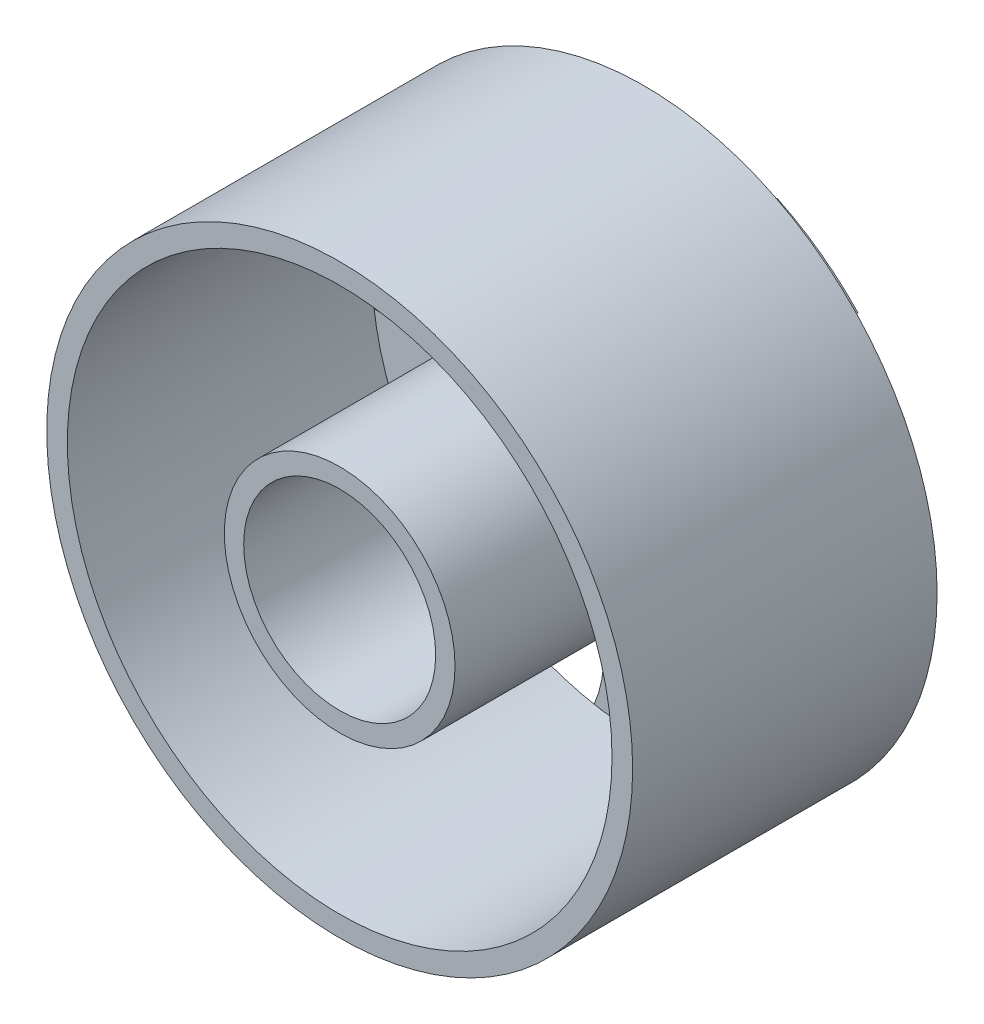
ISO-10303-21;
HEADER;
FILE_DESCRIPTION(('STEP AP214'),'2;1');
FILE_NAME('part.step','',(''),(''),'','','');
FILE_SCHEMA(('AUTOMOTIVE_DESIGN { 1 0 10303 214 1 1 1 1 }'));
ENDSEC;
DATA;
#1=APPLICATION_CONTEXT('core data for automotive mechanical design processes');
#2=APPLICATION_PROTOCOL_DEFINITION('international standard','automotive_design',2000,#1);
#3=PRODUCT_CONTEXT('',#1,'mechanical');
#4=PRODUCT('Part','Part','',(#3));
#5=PRODUCT_RELATED_PRODUCT_CATEGORY('part','',(#4));
#6=PRODUCT_DEFINITION_FORMATION('','',#4);
#7=PRODUCT_DEFINITION_CONTEXT('part definition',#1,'design');
#8=PRODUCT_DEFINITION('design','',#6,#7);
#9=PRODUCT_DEFINITION_SHAPE('','',#8);
#10=(LENGTH_UNIT() NAMED_UNIT(*) SI_UNIT(.MILLI.,.METRE.));
#11=(NAMED_UNIT(*) PLANE_ANGLE_UNIT() SI_UNIT($,.RADIAN.));
#12=(NAMED_UNIT(*) SI_UNIT($,.STERADIAN.) SOLID_ANGLE_UNIT());
#13=UNCERTAINTY_MEASURE_WITH_UNIT(LENGTH_MEASURE(1.E-05),#10,'distance_accuracy_value','');
#14=(GEOMETRIC_REPRESENTATION_CONTEXT(3) GLOBAL_UNCERTAINTY_ASSIGNED_CONTEXT((#13)) GLOBAL_UNIT_ASSIGNED_CONTEXT((#10,
#11,#12)) REPRESENTATION_CONTEXT('',''));
#15=CARTESIAN_POINT('',(0.,0.,0.));
#16=DIRECTION('',(0.,0.,1.));
#17=DIRECTION('',(1.,0.,0.));
#18=AXIS2_PLACEMENT_3D('',#15,#16,#17);
#19=CARTESIAN_POINT('',(0.,0.,-0.762000000000003));
#20=DIRECTION('',(0.,0.,1.));
#21=DIRECTION('',(1.,0.,0.));
#22=AXIS2_PLACEMENT_3D('',#19,#20,#21);
#23=CYLINDRICAL_SURFACE('',#22,12.9511267877965);
#24=CARTESIAN_POINT('',(0.,0.,0.));
#25=DIRECTION('',(0.,0.,-1.));
#26=DIRECTION('',(-1.,0.,0.));
#27=AXIS2_PLACEMENT_3D('',#24,#25,#26);
#28=CIRCLE('',#27,12.9511267877965);
#29=CARTESIAN_POINT('',(5.55941760256822,11.6972031269802,0.));
#30=VERTEX_POINT('',#29);
#31=CARTESIAN_POINT('',(9.40674673832163,8.90195489062125,0.));
#32=VERTEX_POINT('',#31);
#33=EDGE_CURVE('E156',#30,#32,#28,.T.);
#34=ORIENTED_EDGE('',*,*,#33,.T.);
#35=DIRECTION('',(0.,0.,-1.));
#36=VECTOR('',#35,1.);
#37=CARTESIAN_POINT('',(9.40674673832163,8.90195489062124,-0.381000000000001));
#38=LINE('',#37,#36);
#39=CARTESIAN_POINT('',(9.40674673832163,8.90195489062125,-0.762000000000003));
#40=VERTEX_POINT('',#39);
#41=EDGE_CURVE('E13',#32,#40,#38,.T.);
#42=ORIENTED_EDGE('',*,*,#41,.T.);
#43=CARTESIAN_POINT('',(0.,0.,-0.762000000000003));
#44=DIRECTION('',(0.,0.,-1.));
#45=DIRECTION('',(-1.,0.,0.));
#46=AXIS2_PLACEMENT_3D('',#43,#44,#45);
#47=CIRCLE('',#46,12.9511267877965);
#48=CARTESIAN_POINT('',(5.55941760256822,11.6972031269802,-0.762000000000003));
#49=VERTEX_POINT('',#48);
#50=EDGE_CURVE('E158',#49,#40,#47,.T.);
#51=ORIENTED_EDGE('',*,*,#50,.F.);
#52=DIRECTION('',(0.,0.,-1.));
#53=VECTOR('',#52,1.);
#54=CARTESIAN_POINT('',(5.55941760256822,11.6972031269802,-0.381000000000001));
#55=LINE('',#54,#53);
#56=EDGE_CURVE('E215',#49,#30,#55,.F.);
#57=ORIENTED_EDGE('',*,*,#56,.T.);
#58=EDGE_LOOP('',(#34,#42,#51,#57));
#59=FACE_BOUND('',#58,.T.);
#60=ADVANCED_FACE('F57',(#59),#23,.T.);
#61=CARTESIAN_POINT('',(12.8426557743634,-1.67268578483569,-0.762000000000003));
#62=VERTEX_POINT('',#61);
#63=CARTESIAN_POINT('',(11.3731068104133,-6.19549243825786,-0.762000000000003));
#64=VERTEX_POINT('',#63);
#65=EDGE_CURVE('E167',#62,#64,#47,.T.);
#66=ORIENTED_EDGE('',*,*,#65,.F.);
#67=DIRECTION('',(0.,0.,-1.));
#68=VECTOR('',#67,1.);
#69=CARTESIAN_POINT('',(12.8426557743634,-1.67268578483569,-0.381000000000001));
#70=LINE('',#69,#68);
#71=CARTESIAN_POINT('',(12.8426557743634,-1.67268578483569,0.));
#72=VERTEX_POINT('',#71);
#73=EDGE_CURVE('E65',#62,#72,#70,.F.);
#74=ORIENTED_EDGE('',*,*,#73,.T.);
#75=CARTESIAN_POINT('',(11.3731068104133,-6.19549243825786,0.));
#76=VERTEX_POINT('',#75);
#77=EDGE_CURVE('E161',#72,#76,#28,.T.);
#78=ORIENTED_EDGE('',*,*,#77,.T.);
#79=DIRECTION('',(0.,0.,-1.));
#80=VECTOR('',#79,1.);
#81=CARTESIAN_POINT('',(11.3731068104133,-6.19549243825786,-0.381000000000001));
#82=LINE('',#81,#80);
#83=EDGE_CURVE('E190',#76,#64,#82,.T.);
#84=ORIENTED_EDGE('',*,*,#83,.T.);
#85=EDGE_LOOP('',(#66,#74,#78,#84));
#86=FACE_BOUND('',#85,.T.);
#87=ADVANCED_FACE('F200',(#86),#23,.T.);
#88=CARTESIAN_POINT('',(2.37778017180354,-12.7309797945075,-0.762000000000003));
#89=VERTEX_POINT('',#88);
#90=CARTESIAN_POINT('',(-2.37778017180336,-12.7309797945075,-0.762000000000003));
#91=VERTEX_POINT('',#90);
#92=EDGE_CURVE('E159',#89,#91,#47,.T.);
#93=ORIENTED_EDGE('',*,*,#92,.F.);
#94=DIRECTION('',(0.,0.,-1.));
#95=VECTOR('',#94,1.);
#96=CARTESIAN_POINT('',(2.37778017180354,-12.7309797945075,-0.381000000000001));
#97=LINE('',#96,#95);
#98=CARTESIAN_POINT('',(2.37778017180354,-12.7309797945075,0.));
#99=VERTEX_POINT('',#98);
#100=EDGE_CURVE('E184',#89,#99,#97,.F.);
#101=ORIENTED_EDGE('',*,*,#100,.T.);
#102=CARTESIAN_POINT('',(-2.37778017180336,-12.7309797945075,0.));
#103=VERTEX_POINT('',#102);
#104=EDGE_CURVE('E187',#99,#103,#28,.T.);
#105=ORIENTED_EDGE('',*,*,#104,.T.);
#106=DIRECTION('',(0.,0.,-1.));
#107=VECTOR('',#106,1.);
#108=CARTESIAN_POINT('',(-2.37778017180336,-12.7309797945075,-0.381000000000001));
#109=LINE('',#108,#107);
#110=EDGE_CURVE('E186',#103,#91,#109,.T.);
#111=ORIENTED_EDGE('',*,*,#110,.T.);
#112=EDGE_LOOP('',(#93,#101,#105,#111));
#113=FACE_BOUND('',#112,.T.);
#114=ADVANCED_FACE('F182',(#113),#23,.T.);
#115=CARTESIAN_POINT('',(-11.3731068104132,-6.19549243825803,-0.762000000000003));
#116=VERTEX_POINT('',#115);
#117=CARTESIAN_POINT('',(-12.8426557743633,-1.67268578483587,-0.762000000000003));
#118=VERTEX_POINT('',#117);
#119=EDGE_CURVE('E151',#116,#118,#47,.T.);
#120=ORIENTED_EDGE('',*,*,#119,.F.);
#121=DIRECTION('',(0.,0.,-1.));
#122=VECTOR('',#121,1.);
#123=CARTESIAN_POINT('',(-11.3731068104132,-6.19549243825803,-0.381000000000001));
#124=LINE('',#123,#122);
#125=CARTESIAN_POINT('',(-11.3731068104132,-6.19549243825803,0.));
#126=VERTEX_POINT('',#125);
#127=EDGE_CURVE('E188',#116,#126,#124,.F.);
#128=ORIENTED_EDGE('',*,*,#127,.T.);
#129=CARTESIAN_POINT('',(-12.8426557743633,-1.67268578483587,0.));
#130=VERTEX_POINT('',#129);
#131=EDGE_CURVE('E209',#126,#130,#28,.T.);
#132=ORIENTED_EDGE('',*,*,#131,.T.);
#133=DIRECTION('',(0.,0.,-1.));
#134=VECTOR('',#133,1.);
#135=CARTESIAN_POINT('',(-12.8426557743633,-1.67268578483587,-0.381000000000001));
#136=LINE('',#135,#134);
#137=EDGE_CURVE('E139',#130,#118,#136,.T.);
#138=ORIENTED_EDGE('',*,*,#137,.T.);
#139=EDGE_LOOP('',(#120,#128,#132,#138));
#140=FACE_BOUND('',#139,.T.);
#141=ADVANCED_FACE('F221',(#140),#23,.T.);
#142=CARTESIAN_POINT('',(0.,0.,14.478));
#143=DIRECTION('',(0.,0.,-1.));
#144=DIRECTION('',(-1.,0.,0.));
#145=AXIS2_PLACEMENT_3D('',#142,#143,#144);
#146=CYLINDRICAL_SURFACE('',#145,4.56509514749537);
#147=CARTESIAN_POINT('',(0.,0.,14.478));
#148=DIRECTION('',(0.,0.,1.));
#149=DIRECTION('',(1.,0.,0.));
#150=AXIS2_PLACEMENT_3D('',#147,#148,#149);
#151=CIRCLE('',#150,4.56509514749537);
#152=CARTESIAN_POINT('',(4.56509514749537,0.,14.478));
#153=VERTEX_POINT('',#152);
#154=EDGE_CURVE('E170',#153,#153,#151,.T.);
#155=ORIENTED_EDGE('',*,*,#154,.T.);
#156=EDGE_LOOP('',(#155));
#157=FACE_BOUND('',#156,.T.);
#158=CARTESIAN_POINT('',(0.,0.,-0.762000000000003));
#159=DIRECTION('',(0.,0.,1.));
#160=DIRECTION('',(1.,0.,0.));
#161=AXIS2_PLACEMENT_3D('',#158,#159,#160);
#162=CIRCLE('',#161,4.56509514749537);
#163=CARTESIAN_POINT('',(4.56509514749537,0.,-0.762000000000003));
#164=VERTEX_POINT('',#163);
#165=EDGE_CURVE('E235',#164,#164,#162,.T.);
#166=ORIENTED_EDGE('',*,*,#165,.F.);
#167=EDGE_LOOP('',(#166));
#168=FACE_BOUND('',#167,.T.);
#169=ADVANCED_FACE('F59',(#157,#168),#146,.F.);
#170=CARTESIAN_POINT('',(0.,0.,14.478));
#171=DIRECTION('',(0.,0.,-1.));
#172=DIRECTION('',(-1.,0.,0.));
#173=AXIS2_PLACEMENT_3D('',#170,#171,#172);
#174=CYLINDRICAL_SURFACE('',#173,5.485257590083);
#175=CARTESIAN_POINT('',(0.,0.,14.478));
#176=DIRECTION('',(0.,0.,1.));
#177=DIRECTION('',(1.,0.,0.));
#178=AXIS2_PLACEMENT_3D('',#175,#176,#177);
#179=CIRCLE('',#178,5.485257590083);
#180=CARTESIAN_POINT('',(5.485257590083,0.,14.478));
#181=VERTEX_POINT('',#180);
#182=EDGE_CURVE('E213',#181,#181,#179,.T.);
#183=ORIENTED_EDGE('',*,*,#182,.F.);
#184=EDGE_LOOP('',(#183));
#185=FACE_BOUND('',#184,.T.);
#186=CARTESIAN_POINT('',(0.,0.,0.));
#187=DIRECTION('',(0.,0.,1.));
#188=DIRECTION('',(1.,0.,0.));
#189=AXIS2_PLACEMENT_3D('',#186,#187,#188);
#190=CIRCLE('',#189,5.485257590083);
#191=CARTESIAN_POINT('',(5.485257590083,0.,0.));
#192=VERTEX_POINT('',#191);
#193=EDGE_CURVE('E166',#192,#192,#190,.T.);
#194=ORIENTED_EDGE('',*,*,#193,.T.);
#195=EDGE_LOOP('',(#194));
#196=FACE_BOUND('',#195,.T.);
#197=ADVANCED_FACE('F274',(#185,#196),#174,.T.);
#198=CARTESIAN_POINT('',(0.,0.,14.478));
#199=DIRECTION('',(0.,0.,1.));
#200=DIRECTION('',(1.,0.,0.));
#201=AXIS2_PLACEMENT_3D('',#198,#199,#200);
#202=PLANE('',#201);
#203=ORIENTED_EDGE('',*,*,#154,.F.);
#204=EDGE_LOOP('',(#203));
#205=FACE_BOUND('',#204,.T.);
#206=ORIENTED_EDGE('',*,*,#182,.T.);
#207=EDGE_LOOP('',(#206));
#208=FACE_BOUND('',#207,.T.);
#209=ADVANCED_FACE('F301',(#205,#208),#202,.T.);
#210=CARTESIAN_POINT('',(0.,0.,0.));
#211=DIRECTION('',(0.,0.,-1.));
#212=DIRECTION('',(-1.,0.,0.));
#213=AXIS2_PLACEMENT_3D('',#210,#211,#212);
#214=PLANE('',#213);
#215=ORIENTED_EDGE('',*,*,#193,.F.);
#216=EDGE_LOOP('',(#215));
#217=FACE_BOUND('',#216,.T.);
#218=ORIENTED_EDGE('',*,*,#77,.F.);
#219=CARTESIAN_POINT('',(12.3172535248985,4.00211827373388,0.));
#220=DIRECTION('',(0.,0.,-1.));
#221=DIRECTION('',(-0.309016994374958,0.95105651629515,0.));
#222=AXIS2_PLACEMENT_3D('',#219,#220,#221);
#223=CIRCLE('',#222,5.6990743657984);
#224=EDGE_CURVE('E207',#72,#32,#223,.T.);
#225=ORIENTED_EDGE('',*,*,#224,.T.);
#226=ORIENTED_EDGE('',*,*,#33,.F.);
#227=CARTESIAN_POINT('',(0.,12.9511267877965,0.));
#228=DIRECTION('',(0.,0.,-1.));
#229=DIRECTION('',(-1.,0.,0.));
#230=AXIS2_PLACEMENT_3D('',#227,#228,#229);
#231=CIRCLE('',#230,5.6990743657984);
#232=CARTESIAN_POINT('',(-5.55941760256822,11.6972031269802,0.));
#233=VERTEX_POINT('',#232);
#234=EDGE_CURVE('E226',#30,#233,#231,.T.);
#235=ORIENTED_EDGE('',*,*,#234,.T.);
#236=CARTESIAN_POINT('',(-9.40674673832176,8.90195489062111,0.));
#237=VERTEX_POINT('',#236);
#238=EDGE_CURVE('E163',#237,#233,#28,.T.);
#239=ORIENTED_EDGE('',*,*,#238,.F.);
#240=CARTESIAN_POINT('',(-12.3172535248986,4.00211827373371,0.));
#241=DIRECTION('',(0.,0.,-1.));
#242=DIRECTION('',(-0.309016994374945,-0.951056516295155,0.));
#243=AXIS2_PLACEMENT_3D('',#240,#241,#242);
#244=CIRCLE('',#243,5.6990743657984);
#245=EDGE_CURVE('E72',#237,#130,#244,.T.);
#246=ORIENTED_EDGE('',*,*,#245,.T.);
#247=ORIENTED_EDGE('',*,*,#131,.F.);
#248=CARTESIAN_POINT('',(-7.61248132643672,-10.477681667632,0.));
#249=DIRECTION('',(0.,0.,-1.));
#250=DIRECTION('',(0.809016994374951,-0.587785252292469,0.));
#251=AXIS2_PLACEMENT_3D('',#248,#249,#250);
#252=CIRCLE('',#251,5.6990743657984);
#253=EDGE_CURVE('E80',#126,#103,#252,.T.);
#254=ORIENTED_EDGE('',*,*,#253,.T.);
#255=ORIENTED_EDGE('',*,*,#104,.F.);
#256=CARTESIAN_POINT('',(7.61248132643687,-10.4776816676319,0.));
#257=DIRECTION('',(0.,0.,-1.));
#258=DIRECTION('',(0.809016994374942,0.58778525229248,0.));
#259=AXIS2_PLACEMENT_3D('',#256,#257,#258);
#260=CIRCLE('',#259,5.6990743657984);
#261=EDGE_CURVE('E208',#99,#76,#260,.T.);
#262=ORIENTED_EDGE('',*,*,#261,.T.);
#263=EDGE_LOOP('',(#218,#225,#226,#235,#239,#246,#247,#254,#255,#262));
#264=FACE_BOUND('',#263,.T.);
#265=ADVANCED_FACE('F205',(#217,#264),#214,.F.);
#266=CARTESIAN_POINT('',(0.,0.,-0.762000000000003));
#267=DIRECTION('',(0.,0.,-1.));
#268=DIRECTION('',(-1.,0.,0.));
#269=AXIS2_PLACEMENT_3D('',#266,#267,#268);
#270=PLANE('',#269);
#271=ORIENTED_EDGE('',*,*,#165,.T.);
#272=EDGE_LOOP('',(#271));
#273=FACE_BOUND('',#272,.T.);
#274=CARTESIAN_POINT('',(12.3172535248985,4.00211827373388,-0.762000000000003));
#275=DIRECTION('',(0.,0.,-1.));
#276=DIRECTION('',(-0.309016994374958,0.95105651629515,0.));
#277=AXIS2_PLACEMENT_3D('',#274,#275,#276);
#278=CIRCLE('',#277,5.6990743657984);
#279=EDGE_CURVE('E228',#62,#40,#278,.T.);
#280=ORIENTED_EDGE('',*,*,#279,.F.);
#281=ORIENTED_EDGE('',*,*,#65,.T.);
#282=CARTESIAN_POINT('',(7.61248132643687,-10.4776816676319,-0.762000000000003));
#283=DIRECTION('',(0.,0.,-1.));
#284=DIRECTION('',(0.809016994374942,0.58778525229248,0.));
#285=AXIS2_PLACEMENT_3D('',#282,#283,#284);
#286=CIRCLE('',#285,5.6990743657984);
#287=EDGE_CURVE('E178',#89,#64,#286,.T.);
#288=ORIENTED_EDGE('',*,*,#287,.F.);
#289=ORIENTED_EDGE('',*,*,#92,.T.);
#290=CARTESIAN_POINT('',(-7.61248132643672,-10.477681667632,-0.762000000000003));
#291=DIRECTION('',(0.,0.,-1.));
#292=DIRECTION('',(0.809016994374951,-0.587785252292469,0.));
#293=AXIS2_PLACEMENT_3D('',#290,#291,#292);
#294=CIRCLE('',#293,5.6990743657984);
#295=EDGE_CURVE('E177',#116,#91,#294,.T.);
#296=ORIENTED_EDGE('',*,*,#295,.F.);
#297=ORIENTED_EDGE('',*,*,#119,.T.);
#298=CARTESIAN_POINT('',(-12.3172535248986,4.00211827373371,-0.762000000000003));
#299=DIRECTION('',(0.,0.,-1.));
#300=DIRECTION('',(-0.309016994374945,-0.951056516295155,0.));
#301=AXIS2_PLACEMENT_3D('',#298,#299,#300);
#302=CIRCLE('',#301,5.6990743657984);
#303=CARTESIAN_POINT('',(-9.40674673832176,8.90195489062111,-0.762000000000003));
#304=VERTEX_POINT('',#303);
#305=EDGE_CURVE('E134',#304,#118,#302,.T.);
#306=ORIENTED_EDGE('',*,*,#305,.F.);
#307=CARTESIAN_POINT('',(-5.55941760256822,11.6972031269802,-0.762000000000003));
#308=VERTEX_POINT('',#307);
#309=EDGE_CURVE('E147',#304,#308,#47,.T.);
#310=ORIENTED_EDGE('',*,*,#309,.T.);
#311=CARTESIAN_POINT('',(0.,12.9511267877965,-0.762000000000003));
#312=DIRECTION('',(0.,0.,-1.));
#313=DIRECTION('',(-1.,0.,0.));
#314=AXIS2_PLACEMENT_3D('',#311,#312,#313);
#315=CIRCLE('',#314,5.6990743657984);
#316=EDGE_CURVE('E224',#49,#308,#315,.T.);
#317=ORIENTED_EDGE('',*,*,#316,.F.);
#318=ORIENTED_EDGE('',*,*,#50,.T.);
#319=EDGE_LOOP('',(#280,#281,#288,#289,#296,#297,#306,#310,#317,#318));
#320=FACE_BOUND('',#319,.T.);
#321=ADVANCED_FACE('F145',(#273,#320),#270,.T.);
#322=ORIENTED_EDGE('',*,*,#309,.F.);
#323=DIRECTION('',(0.,0.,-1.));
#324=VECTOR('',#323,1.);
#325=CARTESIAN_POINT('',(-9.40674673832176,8.90195489062111,-0.381000000000001));
#326=LINE('',#325,#324);
#327=EDGE_CURVE('E131',#304,#237,#326,.F.);
#328=ORIENTED_EDGE('',*,*,#327,.T.);
#329=ORIENTED_EDGE('',*,*,#238,.T.);
#330=DIRECTION('',(0.,0.,-1.));
#331=VECTOR('',#330,1.);
#332=CARTESIAN_POINT('',(-5.55941760256822,11.6972031269802,-0.381000000000001));
#333=LINE('',#332,#331);
#334=EDGE_CURVE('E140',#233,#308,#333,.T.);
#335=ORIENTED_EDGE('',*,*,#334,.T.);
#336=EDGE_LOOP('',(#322,#328,#329,#335));
#337=FACE_BOUND('',#336,.T.);
#338=ADVANCED_FACE('F154',(#337),#23,.T.);
#339=CARTESIAN_POINT('',(0.,12.9511267877965,0.));
#340=DIRECTION('',(0.,0.,-1.));
#341=DIRECTION('',(-1.,0.,0.));
#342=AXIS2_PLACEMENT_3D('',#339,#340,#341);
#343=CYLINDRICAL_SURFACE('',#342,5.6990743657984);
#344=ORIENTED_EDGE('',*,*,#234,.F.);
#345=ORIENTED_EDGE('',*,*,#56,.F.);
#346=ORIENTED_EDGE('',*,*,#316,.T.);
#347=ORIENTED_EDGE('',*,*,#334,.F.);
#348=EDGE_LOOP('',(#344,#345,#346,#347));
#349=FACE_BOUND('',#348,.T.);
#350=ADVANCED_FACE('F232',(#349),#343,.F.);
#351=CARTESIAN_POINT('',(-12.3172535248986,4.00211827373371,0.));
#352=DIRECTION('',(0.,0.,-1.));
#353=DIRECTION('',(-1.,0.,0.));
#354=AXIS2_PLACEMENT_3D('',#351,#352,#353);
#355=CYLINDRICAL_SURFACE('',#354,5.6990743657984);
#356=ORIENTED_EDGE('',*,*,#245,.F.);
#357=ORIENTED_EDGE('',*,*,#327,.F.);
#358=ORIENTED_EDGE('',*,*,#305,.T.);
#359=ORIENTED_EDGE('',*,*,#137,.F.);
#360=EDGE_LOOP('',(#356,#357,#358,#359));
#361=FACE_BOUND('',#360,.T.);
#362=ADVANCED_FACE('F133',(#361),#355,.F.);
#363=CARTESIAN_POINT('',(-7.61248132643672,-10.477681667632,0.));
#364=DIRECTION('',(0.,0.,-1.));
#365=DIRECTION('',(-1.,0.,0.));
#366=AXIS2_PLACEMENT_3D('',#363,#364,#365);
#367=CYLINDRICAL_SURFACE('',#366,5.6990743657984);
#368=ORIENTED_EDGE('',*,*,#253,.F.);
#369=ORIENTED_EDGE('',*,*,#127,.F.);
#370=ORIENTED_EDGE('',*,*,#295,.T.);
#371=ORIENTED_EDGE('',*,*,#110,.F.);
#372=EDGE_LOOP('',(#368,#369,#370,#371));
#373=FACE_BOUND('',#372,.T.);
#374=ADVANCED_FACE('F247',(#373),#367,.F.);
#375=CARTESIAN_POINT('',(7.61248132643687,-10.4776816676319,0.));
#376=DIRECTION('',(0.,0.,-1.));
#377=DIRECTION('',(-1.,0.,0.));
#378=AXIS2_PLACEMENT_3D('',#375,#376,#377);
#379=CYLINDRICAL_SURFACE('',#378,5.6990743657984);
#380=ORIENTED_EDGE('',*,*,#261,.F.);
#381=ORIENTED_EDGE('',*,*,#100,.F.);
#382=ORIENTED_EDGE('',*,*,#287,.T.);
#383=ORIENTED_EDGE('',*,*,#83,.F.);
#384=EDGE_LOOP('',(#380,#381,#382,#383));
#385=FACE_BOUND('',#384,.T.);
#386=ADVANCED_FACE('F245',(#385),#379,.F.);
#387=CARTESIAN_POINT('',(12.3172535248985,4.00211827373388,0.));
#388=DIRECTION('',(0.,0.,-1.));
#389=DIRECTION('',(-1.,0.,0.));
#390=AXIS2_PLACEMENT_3D('',#387,#388,#389);
#391=CYLINDRICAL_SURFACE('',#390,5.6990743657984);
#392=ORIENTED_EDGE('',*,*,#224,.F.);
#393=ORIENTED_EDGE('',*,*,#73,.F.);
#394=ORIENTED_EDGE('',*,*,#279,.T.);
#395=ORIENTED_EDGE('',*,*,#41,.F.);
#396=EDGE_LOOP('',(#392,#393,#394,#395));
#397=FACE_BOUND('',#396,.T.);
#398=ADVANCED_FACE('F234',(#397),#391,.F.);
#399=CLOSED_SHELL('',(#60,#87,#114,#141,#169,#197,#209,#265,#321,#338,#350,#362,#374,#386,#398));
#400=MANIFOLD_SOLID_BREP('B2',#399);
#401=CARTESIAN_POINT('',(0.,0.,14.478));
#402=DIRECTION('',(0.,0.,-1.));
#403=DIRECTION('',(-1.,0.,0.));
#404=AXIS2_PLACEMENT_3D('',#401,#402,#403);
#405=CYLINDRICAL_SURFACE('',#404,12.9511267877965);
#406=CARTESIAN_POINT('',(0.,0.,14.478));
#407=DIRECTION('',(0.,0.,1.));
#408=DIRECTION('',(1.,0.,0.));
#409=AXIS2_PLACEMENT_3D('',#406,#407,#408);
#410=CIRCLE('',#409,12.9511267877965);
#411=CARTESIAN_POINT('',(12.9511267877965,0.,14.478));
#412=VERTEX_POINT('',#411);
#413=EDGE_CURVE('E388',#412,#412,#410,.T.);
#414=ORIENTED_EDGE('',*,*,#413,.T.);
#415=EDGE_LOOP('',(#414));
#416=FACE_BOUND('',#415,.T.);
#417=CARTESIAN_POINT('',(0.,0.,0.));
#418=DIRECTION('',(0.,0.,1.));
#419=DIRECTION('',(1.,0.,0.));
#420=AXIS2_PLACEMENT_3D('',#417,#418,#419);
#421=CIRCLE('',#420,12.9511267877965);
#422=CARTESIAN_POINT('',(12.9511267877965,0.,0.));
#423=VERTEX_POINT('',#422);
#424=EDGE_CURVE('E394',#423,#423,#421,.T.);
#425=ORIENTED_EDGE('',*,*,#424,.F.);
#426=EDGE_LOOP('',(#425));
#427=FACE_BOUND('',#426,.T.);
#428=ADVANCED_FACE('F381',(#416,#427),#405,.F.);
#429=CARTESIAN_POINT('',(0.,0.,14.478));
#430=DIRECTION('',(0.,0.,-1.));
#431=DIRECTION('',(-1.,0.,0.));
#432=AXIS2_PLACEMENT_3D('',#429,#430,#431);
#433=CYLINDRICAL_SURFACE('',#432,13.9310342952632);
#434=CARTESIAN_POINT('',(0.,0.,14.478));
#435=DIRECTION('',(0.,0.,1.));
#436=DIRECTION('',(1.,0.,0.));
#437=AXIS2_PLACEMENT_3D('',#434,#435,#436);
#438=CIRCLE('',#437,13.9310342952632);
#439=CARTESIAN_POINT('',(13.9310342952632,0.,14.478));
#440=VERTEX_POINT('',#439);
#441=EDGE_CURVE('E56',#440,#440,#438,.T.);
#442=ORIENTED_EDGE('',*,*,#441,.F.);
#443=EDGE_LOOP('',(#442));
#444=FACE_BOUND('',#443,.T.);
#445=CARTESIAN_POINT('',(0.,0.,0.));
#446=DIRECTION('',(0.,0.,1.));
#447=DIRECTION('',(1.,0.,0.));
#448=AXIS2_PLACEMENT_3D('',#445,#446,#447);
#449=CIRCLE('',#448,13.9310342952632);
#450=CARTESIAN_POINT('',(13.9310342952632,0.,0.));
#451=VERTEX_POINT('',#450);
#452=EDGE_CURVE('E384',#451,#451,#449,.T.);
#453=ORIENTED_EDGE('',*,*,#452,.T.);
#454=EDGE_LOOP('',(#453));
#455=FACE_BOUND('',#454,.T.);
#456=ADVANCED_FACE('F401',(#444,#455),#433,.T.);
#457=CARTESIAN_POINT('',(0.,0.,14.478));
#458=DIRECTION('',(0.,0.,1.));
#459=DIRECTION('',(1.,0.,0.));
#460=AXIS2_PLACEMENT_3D('',#457,#458,#459);
#461=PLANE('',#460);
#462=ORIENTED_EDGE('',*,*,#413,.F.);
#463=EDGE_LOOP('',(#462));
#464=FACE_BOUND('',#463,.T.);
#465=ORIENTED_EDGE('',*,*,#441,.T.);
#466=EDGE_LOOP('',(#465));
#467=FACE_BOUND('',#466,.T.);
#468=ADVANCED_FACE('F405',(#464,#467),#461,.T.);
#469=CARTESIAN_POINT('',(0.,0.,0.));
#470=DIRECTION('',(0.,0.,1.));
#471=DIRECTION('',(1.,0.,0.));
#472=AXIS2_PLACEMENT_3D('',#469,#470,#471);
#473=PLANE('',#472);
#474=ORIENTED_EDGE('',*,*,#424,.T.);
#475=EDGE_LOOP('',(#474));
#476=FACE_BOUND('',#475,.T.);
#477=ORIENTED_EDGE('',*,*,#452,.F.);
#478=EDGE_LOOP('',(#477));
#479=FACE_BOUND('',#478,.T.);
#480=ADVANCED_FACE('F403',(#476,#479),#473,.F.);
#481=CLOSED_SHELL('',(#428,#456,#468,#480));
#482=MANIFOLD_SOLID_BREP('B7',#481);
#483=ADVANCED_BREP_SHAPE_REPRESENTATION('',(#18,#400,#482),#14);
#484=SHAPE_DEFINITION_REPRESENTATION(#9,#483);
ENDSEC;
END-ISO-10303-21;
